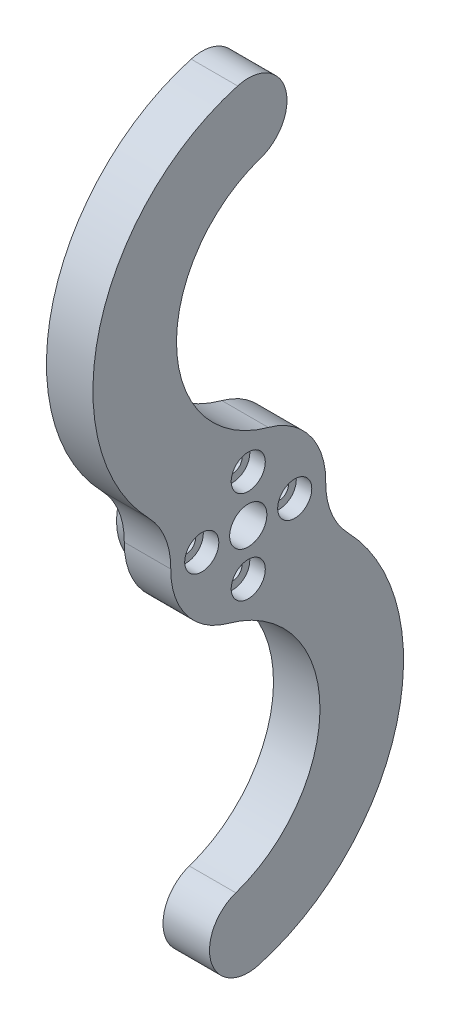
ISO-10303-21;
HEADER;
FILE_DESCRIPTION(('STEP AP214'),'2;1');
FILE_NAME('part.step','',(''),(''),'','','');
FILE_SCHEMA(('AUTOMOTIVE_DESIGN { 1 0 10303 214 1 1 1 1 }'));
ENDSEC;
DATA;
#1=APPLICATION_CONTEXT('core data for automotive mechanical design processes');
#2=APPLICATION_PROTOCOL_DEFINITION('international standard','automotive_design',2000,#1);
#3=PRODUCT_CONTEXT('',#1,'mechanical');
#4=PRODUCT('Part','Part','',(#3));
#5=PRODUCT_RELATED_PRODUCT_CATEGORY('part','',(#4));
#6=PRODUCT_DEFINITION_FORMATION('','',#4);
#7=PRODUCT_DEFINITION_CONTEXT('part definition',#1,'design');
#8=PRODUCT_DEFINITION('design','',#6,#7);
#9=PRODUCT_DEFINITION_SHAPE('','',#8);
#10=(LENGTH_UNIT() NAMED_UNIT(*) SI_UNIT(.MILLI.,.METRE.));
#11=(NAMED_UNIT(*) PLANE_ANGLE_UNIT() SI_UNIT($,.RADIAN.));
#12=(NAMED_UNIT(*) SI_UNIT($,.STERADIAN.) SOLID_ANGLE_UNIT());
#13=UNCERTAINTY_MEASURE_WITH_UNIT(LENGTH_MEASURE(1.E-05),#10,'distance_accuracy_value','');
#14=(GEOMETRIC_REPRESENTATION_CONTEXT(3) GLOBAL_UNCERTAINTY_ASSIGNED_CONTEXT((#13)) GLOBAL_UNIT_ASSIGNED_CONTEXT((#10,
#11,#12)) REPRESENTATION_CONTEXT('',''));
#15=CARTESIAN_POINT('',(0.,0.,0.));
#16=DIRECTION('',(0.,0.,1.));
#17=DIRECTION('',(1.,0.,0.));
#18=AXIS2_PLACEMENT_3D('',#15,#16,#17);
#19=CARTESIAN_POINT('',(0.,-12.5555555555556,3.37016686402291));
#20=DIRECTION('',(1.,0.,0.));
#21=DIRECTION('',(0.,0.,-1.));
#22=AXIS2_PLACEMENT_3D('',#19,#20,#21);
#23=PLANE('',#22);
#24=CARTESIAN_POINT('',(0.,-25.1111111111111,6.74033372804582));
#25=DIRECTION('',(-1.,0.,0.));
#26=DIRECTION('',(0.,0.,-1.));
#27=AXIS2_PLACEMENT_3D('',#24,#25,#26);
#28=CIRCLE('',#27,16.);
#29=CARTESIAN_POINT('',(0.,-9.65811965811966,2.5924360492484));
#30=VERTEX_POINT('',#29);
#31=CARTESIAN_POINT('',(0.,-40.2645502645503,1.60484136382043));
#32=VERTEX_POINT('',#31);
#33=EDGE_CURVE('E141',#30,#32,#28,.T.);
#34=ORIENTED_EDGE('',*,*,#33,.F.);
#35=CARTESIAN_POINT('',(0.,0.,0.));
#36=DIRECTION('',(1.,0.,0.));
#37=DIRECTION('',(0.,0.,-1.));
#38=AXIS2_PLACEMENT_3D('',#35,#36,#37);
#39=CIRCLE('',#38,10.);
#40=CARTESIAN_POINT('',(0.,0.123180910510112,9.99924129438259));
#41=VERTEX_POINT('',#40);
#42=EDGE_CURVE('E137',#41,#30,#39,.T.);
#43=ORIENTED_EDGE('',*,*,#42,.F.);
#44=CARTESIAN_POINT('',(0.,0.246361821020225,19.9984825887652));
#45=DIRECTION('',(1.,0.,0.));
#46=DIRECTION('',(0.,0.,-1.));
#47=AXIS2_PLACEMENT_3D('',#44,#45,#46);
#48=CIRCLE('',#47,10.);
#49=CARTESIAN_POINT('',(0.,7.20017566674365,12.8120736803447));
#50=VERTEX_POINT('',#49);
#51=EDGE_CURVE('E46',#41,#50,#48,.T.);
#52=ORIENTED_EDGE('',*,*,#51,.T.);
#53=CARTESIAN_POINT('',(0.,25.0789757885209,-5.66474656787445));
#54=DIRECTION('',(1.,0.,0.));
#55=DIRECTION('',(0.,0.,-1.));
#56=AXIS2_PLACEMENT_3D('',#53,#54,#55);
#57=CIRCLE('',#56,25.7107833462823);
#58=CARTESIAN_POINT('',(0.,49.8093362473069,1.3675824814506));
#59=VERTEX_POINT('',#58);
#60=EDGE_CURVE('E195',#59,#50,#57,.T.);
#61=ORIENTED_EDGE('',*,*,#60,.F.);
#62=CARTESIAN_POINT('',(0.,45.,-1.10295661595465E-06));
#63=DIRECTION('',(1.,0.,0.));
#64=DIRECTION('',(0.,0.,-1.));
#65=AXIS2_PLACEMENT_3D('',#62,#63,#64);
#66=CIRCLE('',#65,5.);
#67=CARTESIAN_POINT('',(0.,40.2645502252154,-1.60484235071048));
#68=VERTEX_POINT('',#67);
#69=EDGE_CURVE('E193',#68,#59,#66,.T.);
#70=ORIENTED_EDGE('',*,*,#69,.F.);
#71=CARTESIAN_POINT('',(0.,25.1111109459045,-6.74033434352284));
#72=DIRECTION('',(-1.,0.,0.));
#73=DIRECTION('',(0.,0.,-1.));
#74=AXIS2_PLACEMENT_3D('',#71,#72,#73);
#75=CIRCLE('',#74,16.);
#76=CARTESIAN_POINT('',(0.,9.65811959457867,-2.59243628597033));
#77=VERTEX_POINT('',#76);
#78=EDGE_CURVE('E187',#77,#68,#75,.T.);
#79=ORIENTED_EDGE('',*,*,#78,.F.);
#80=CARTESIAN_POINT('',(0.,0.,0.));
#81=DIRECTION('',(1.,0.,0.));
#82=DIRECTION('',(0.,0.,-1.));
#83=AXIS2_PLACEMENT_3D('',#80,#81,#82);
#84=CIRCLE('',#83,10.);
#85=CARTESIAN_POINT('',(0.,-0.123180665427243,-9.99924129740177));
#86=VERTEX_POINT('',#85);
#87=EDGE_CURVE('E182',#86,#77,#84,.T.);
#88=ORIENTED_EDGE('',*,*,#87,.F.);
#89=CARTESIAN_POINT('',(0.,-0.246361330854486,-19.9984825948035));
#90=DIRECTION('',(1.,0.,0.));
#91=DIRECTION('',(0.,0.,-1.));
#92=AXIS2_PLACEMENT_3D('',#89,#90,#91);
#93=CIRCLE('',#92,10.);
#94=CARTESIAN_POINT('',(0.,-7.20017535271785,-12.8120738568221));
#95=VERTEX_POINT('',#94);
#96=EDGE_CURVE('E159',#86,#95,#93,.T.);
#97=ORIENTED_EDGE('',*,*,#96,.T.);
#98=CARTESIAN_POINT('',(0.,-25.0789759273647,5.66474595318508));
#99=DIRECTION('',(1.,0.,0.));
#100=DIRECTION('',(0.,0.,-1.));
#101=AXIS2_PLACEMENT_3D('',#98,#99,#100);
#102=CIRCLE('',#101,25.7107833462823);
#103=CARTESIAN_POINT('',(0.,-49.8093362137872,-1.36758370228472));
#104=VERTEX_POINT('',#103);
#105=EDGE_CURVE('E180',#104,#95,#102,.T.);
#106=ORIENTED_EDGE('',*,*,#105,.F.);
#107=CARTESIAN_POINT('',(0.,-45.,0.));
#108=DIRECTION('',(1.,0.,0.));
#109=DIRECTION('',(0.,0.,-1.));
#110=AXIS2_PLACEMENT_3D('',#107,#108,#109);
#111=CIRCLE('',#110,5.);
#112=EDGE_CURVE('E185',#32,#104,#111,.T.);
#113=ORIENTED_EDGE('',*,*,#112,.F.);
#114=EDGE_LOOP('',(#34,#43,#52,#61,#70,#79,#88,#97,#106,#113));
#115=FACE_BOUND('',#114,.T.);
#116=CARTESIAN_POINT('',(0.,0.,0.));
#117=DIRECTION('',(1.,0.,0.));
#118=DIRECTION('',(0.,0.,-1.));
#119=AXIS2_PLACEMENT_3D('',#116,#117,#118);
#120=CIRCLE('',#119,8.);
#121=CARTESIAN_POINT('',(0.,0.,-8.));
#122=VERTEX_POINT('',#121);
#123=EDGE_CURVE('E142',#122,#122,#120,.F.);
#124=ORIENTED_EDGE('',*,*,#123,.F.);
#125=EDGE_LOOP('',(#124));
#126=FACE_BOUND('',#125,.T.);
#127=ADVANCED_FACE('F38',(#115,#126),#23,.F.);
#128=CARTESIAN_POINT('',(6.,-12.5555555555556,3.37016686402291));
#129=DIRECTION('',(1.,0.,0.));
#130=DIRECTION('',(0.,0.,-1.));
#131=AXIS2_PLACEMENT_3D('',#128,#129,#130);
#132=PLANE('',#131);
#133=CARTESIAN_POINT('',(6.,-6.,0.));
#134=DIRECTION('',(1.,0.,0.));
#135=DIRECTION('',(0.,0.,-1.));
#136=AXIS2_PLACEMENT_3D('',#133,#134,#135);
#137=CIRCLE('',#136,2.2);
#138=CARTESIAN_POINT('',(6.,-6.,-2.2));
#139=VERTEX_POINT('',#138);
#140=EDGE_CURVE('E279',#139,#139,#137,.T.);
#141=ORIENTED_EDGE('',*,*,#140,.F.);
#142=EDGE_LOOP('',(#141));
#143=FACE_BOUND('',#142,.T.);
#144=CARTESIAN_POINT('',(6.,0.,6.));
#145=DIRECTION('',(1.,0.,0.));
#146=DIRECTION('',(0.,0.,-1.));
#147=AXIS2_PLACEMENT_3D('',#144,#145,#146);
#148=CIRCLE('',#147,2.2);
#149=CARTESIAN_POINT('',(6.,0.,3.8));
#150=VERTEX_POINT('',#149);
#151=EDGE_CURVE('E267',#150,#150,#148,.T.);
#152=ORIENTED_EDGE('',*,*,#151,.F.);
#153=EDGE_LOOP('',(#152));
#154=FACE_BOUND('',#153,.T.);
#155=CARTESIAN_POINT('',(6.,6.,0.));
#156=DIRECTION('',(1.,0.,0.));
#157=DIRECTION('',(0.,0.,-1.));
#158=AXIS2_PLACEMENT_3D('',#155,#156,#157);
#159=CIRCLE('',#158,2.2);
#160=CARTESIAN_POINT('',(6.,6.,-2.2));
#161=VERTEX_POINT('',#160);
#162=EDGE_CURVE('E255',#161,#161,#159,.T.);
#163=ORIENTED_EDGE('',*,*,#162,.F.);
#164=EDGE_LOOP('',(#163));
#165=FACE_BOUND('',#164,.T.);
#166=CARTESIAN_POINT('',(6.,0.,-6.));
#167=DIRECTION('',(1.,0.,0.));
#168=DIRECTION('',(0.,0.,-1.));
#169=AXIS2_PLACEMENT_3D('',#166,#167,#168);
#170=CIRCLE('',#169,2.2);
#171=CARTESIAN_POINT('',(6.,0.,-8.2));
#172=VERTEX_POINT('',#171);
#173=EDGE_CURVE('E243',#172,#172,#170,.T.);
#174=ORIENTED_EDGE('',*,*,#173,.F.);
#175=EDGE_LOOP('',(#174));
#176=FACE_BOUND('',#175,.T.);
#177=CARTESIAN_POINT('',(6.,-25.1111111111111,6.74033372804582));
#178=DIRECTION('',(-1.,0.,0.));
#179=DIRECTION('',(0.,0.,-1.));
#180=AXIS2_PLACEMENT_3D('',#177,#178,#179);
#181=CIRCLE('',#180,16.);
#182=CARTESIAN_POINT('',(6.,-9.65811965811966,2.5924360492484));
#183=VERTEX_POINT('',#182);
#184=CARTESIAN_POINT('',(6.,-40.2645502645503,1.60484136382043));
#185=VERTEX_POINT('',#184);
#186=EDGE_CURVE('E127',#183,#185,#181,.T.);
#187=ORIENTED_EDGE('',*,*,#186,.T.);
#188=CARTESIAN_POINT('',(6.,-45.,0.));
#189=DIRECTION('',(1.,0.,0.));
#190=DIRECTION('',(0.,0.,-1.));
#191=AXIS2_PLACEMENT_3D('',#188,#189,#190);
#192=CIRCLE('',#191,5.);
#193=CARTESIAN_POINT('',(6.,-49.8093362137872,-1.36758370228472));
#194=VERTEX_POINT('',#193);
#195=EDGE_CURVE('E115',#185,#194,#192,.T.);
#196=ORIENTED_EDGE('',*,*,#195,.T.);
#197=CARTESIAN_POINT('',(6.,-25.0789759273647,5.66474595318508));
#198=DIRECTION('',(1.,0.,0.));
#199=DIRECTION('',(0.,0.,-1.));
#200=AXIS2_PLACEMENT_3D('',#197,#198,#199);
#201=CIRCLE('',#200,25.7107833462823);
#202=CARTESIAN_POINT('',(6.,-7.20017535271785,-12.8120738568221));
#203=VERTEX_POINT('',#202);
#204=EDGE_CURVE('E126',#194,#203,#201,.T.);
#205=ORIENTED_EDGE('',*,*,#204,.T.);
#206=CARTESIAN_POINT('',(6.,-0.246361330854486,-19.9984825948035));
#207=DIRECTION('',(1.,0.,0.));
#208=DIRECTION('',(0.,0.,-1.));
#209=AXIS2_PLACEMENT_3D('',#206,#207,#208);
#210=CIRCLE('',#209,10.);
#211=CARTESIAN_POINT('',(6.,-0.123180665427243,-9.99924129740177));
#212=VERTEX_POINT('',#211);
#213=EDGE_CURVE('E161',#203,#212,#210,.F.);
#214=ORIENTED_EDGE('',*,*,#213,.T.);
#215=CARTESIAN_POINT('',(6.,0.,0.));
#216=DIRECTION('',(1.,0.,0.));
#217=DIRECTION('',(0.,0.,-1.));
#218=AXIS2_PLACEMENT_3D('',#215,#216,#217);
#219=CIRCLE('',#218,10.);
#220=CARTESIAN_POINT('',(6.,9.65811959457867,-2.59243628597033));
#221=VERTEX_POINT('',#220);
#222=EDGE_CURVE('E164',#212,#221,#219,.T.);
#223=ORIENTED_EDGE('',*,*,#222,.T.);
#224=CARTESIAN_POINT('',(6.,25.1111109459045,-6.74033434352284));
#225=DIRECTION('',(-1.,0.,0.));
#226=DIRECTION('',(0.,0.,-1.));
#227=AXIS2_PLACEMENT_3D('',#224,#225,#226);
#228=CIRCLE('',#227,16.);
#229=CARTESIAN_POINT('',(6.,40.2645502252154,-1.60484235071048));
#230=VERTEX_POINT('',#229);
#231=EDGE_CURVE('E174',#221,#230,#228,.T.);
#232=ORIENTED_EDGE('',*,*,#231,.T.);
#233=CARTESIAN_POINT('',(6.,45.,-1.10295661595465E-06));
#234=DIRECTION('',(1.,0.,0.));
#235=DIRECTION('',(0.,0.,-1.));
#236=AXIS2_PLACEMENT_3D('',#233,#234,#235);
#237=CIRCLE('',#236,5.);
#238=CARTESIAN_POINT('',(6.,49.8093362473069,1.3675824814506));
#239=VERTEX_POINT('',#238);
#240=EDGE_CURVE('E216',#230,#239,#237,.T.);
#241=ORIENTED_EDGE('',*,*,#240,.T.);
#242=CARTESIAN_POINT('',(6.,25.0789757885209,-5.66474656787445));
#243=DIRECTION('',(1.,0.,0.));
#244=DIRECTION('',(0.,0.,-1.));
#245=AXIS2_PLACEMENT_3D('',#242,#243,#244);
#246=CIRCLE('',#245,25.7107833462823);
#247=CARTESIAN_POINT('',(6.,7.20017566674365,12.8120736803447));
#248=VERTEX_POINT('',#247);
#249=EDGE_CURVE('E214',#239,#248,#246,.T.);
#250=ORIENTED_EDGE('',*,*,#249,.T.);
#251=CARTESIAN_POINT('',(6.,0.246361821020225,19.9984825887652));
#252=DIRECTION('',(1.,0.,0.));
#253=DIRECTION('',(0.,0.,-1.));
#254=AXIS2_PLACEMENT_3D('',#251,#252,#253);
#255=CIRCLE('',#254,10.);
#256=CARTESIAN_POINT('',(6.,0.123180910510112,9.99924129438259));
#257=VERTEX_POINT('',#256);
#258=EDGE_CURVE('E11',#248,#257,#255,.F.);
#259=ORIENTED_EDGE('',*,*,#258,.T.);
#260=CARTESIAN_POINT('',(6.,0.,0.));
#261=DIRECTION('',(1.,0.,0.));
#262=DIRECTION('',(0.,0.,-1.));
#263=AXIS2_PLACEMENT_3D('',#260,#261,#262);
#264=CIRCLE('',#263,10.);
#265=EDGE_CURVE('E133',#257,#183,#264,.T.);
#266=ORIENTED_EDGE('',*,*,#265,.T.);
#267=EDGE_LOOP('',(#187,#196,#205,#214,#223,#232,#241,#250,#259,#266));
#268=FACE_BOUND('',#267,.T.);
#269=CARTESIAN_POINT('',(6.,0.,0.));
#270=DIRECTION('',(1.,0.,0.));
#271=DIRECTION('',(0.,0.,-1.));
#272=AXIS2_PLACEMENT_3D('',#269,#270,#271);
#273=CIRCLE('',#272,2.4);
#274=CARTESIAN_POINT('',(6.,0.,-2.4));
#275=VERTEX_POINT('',#274);
#276=EDGE_CURVE('E221',#275,#275,#273,.T.);
#277=ORIENTED_EDGE('',*,*,#276,.F.);
#278=EDGE_LOOP('',(#277));
#279=FACE_BOUND('',#278,.T.);
#280=ADVANCED_FACE('F130',(#143,#154,#165,#176,#268,#279),#132,.T.);
#281=CARTESIAN_POINT('',(6.,-25.1111111111111,6.74033372804582));
#282=DIRECTION('',(-1.,0.,0.));
#283=DIRECTION('',(0.,0.,1.));
#284=AXIS2_PLACEMENT_3D('',#281,#282,#283);
#285=CYLINDRICAL_SURFACE('',#284,16.);
#286=ORIENTED_EDGE('',*,*,#33,.T.);
#287=DIRECTION('',(-1.,0.,0.));
#288=VECTOR('',#287,1.);
#289=CARTESIAN_POINT('',(6.,-40.2645502645503,1.60484136382043));
#290=LINE('',#289,#288);
#291=EDGE_CURVE('E119',#185,#32,#290,.T.);
#292=ORIENTED_EDGE('',*,*,#291,.F.);
#293=ORIENTED_EDGE('',*,*,#186,.F.);
#294=DIRECTION('',(-1.,0.,0.));
#295=VECTOR('',#294,1.);
#296=CARTESIAN_POINT('',(6.,-9.65811965811966,2.5924360492484));
#297=LINE('',#296,#295);
#298=EDGE_CURVE('E198',#183,#30,#297,.T.);
#299=ORIENTED_EDGE('',*,*,#298,.T.);
#300=EDGE_LOOP('',(#286,#292,#293,#299));
#301=FACE_BOUND('',#300,.T.);
#302=ADVANCED_FACE('F139',(#301),#285,.F.);
#303=CARTESIAN_POINT('',(6.,-45.,0.));
#304=DIRECTION('',(-1.,0.,0.));
#305=DIRECTION('',(0.,0.,1.));
#306=AXIS2_PLACEMENT_3D('',#303,#304,#305);
#307=CYLINDRICAL_SURFACE('',#306,5.);
#308=ORIENTED_EDGE('',*,*,#112,.T.);
#309=DIRECTION('',(-1.,0.,0.));
#310=VECTOR('',#309,1.);
#311=CARTESIAN_POINT('',(6.,-49.8093362137872,-1.36758370228472));
#312=LINE('',#311,#310);
#313=EDGE_CURVE('E122',#194,#104,#312,.T.);
#314=ORIENTED_EDGE('',*,*,#313,.F.);
#315=ORIENTED_EDGE('',*,*,#195,.F.);
#316=ORIENTED_EDGE('',*,*,#291,.T.);
#317=EDGE_LOOP('',(#308,#314,#315,#316));
#318=FACE_BOUND('',#317,.T.);
#319=ADVANCED_FACE('F117',(#318),#307,.T.);
#320=CARTESIAN_POINT('',(6.,-25.0789759273647,5.66474595318508));
#321=DIRECTION('',(-1.,0.,0.));
#322=DIRECTION('',(0.,0.,1.));
#323=AXIS2_PLACEMENT_3D('',#320,#321,#322);
#324=CYLINDRICAL_SURFACE('',#323,25.7107833462823);
#325=ORIENTED_EDGE('',*,*,#105,.T.);
#326=DIRECTION('',(-1.,0.,0.));
#327=VECTOR('',#326,1.);
#328=CARTESIAN_POINT('',(6.,-7.20017535271784,-12.8120738568221));
#329=LINE('',#328,#327);
#330=EDGE_CURVE('E153',#95,#203,#329,.F.);
#331=ORIENTED_EDGE('',*,*,#330,.T.);
#332=ORIENTED_EDGE('',*,*,#204,.F.);
#333=ORIENTED_EDGE('',*,*,#313,.T.);
#334=EDGE_LOOP('',(#325,#331,#332,#333));
#335=FACE_BOUND('',#334,.T.);
#336=ADVANCED_FACE('F184',(#335),#324,.T.);
#337=CARTESIAN_POINT('',(6.,0.,0.));
#338=DIRECTION('',(-1.,0.,0.));
#339=DIRECTION('',(0.,0.,1.));
#340=AXIS2_PLACEMENT_3D('',#337,#338,#339);
#341=CYLINDRICAL_SURFACE('',#340,10.);
#342=ORIENTED_EDGE('',*,*,#222,.F.);
#343=DIRECTION('',(-1.,0.,0.));
#344=VECTOR('',#343,1.);
#345=CARTESIAN_POINT('',(6.,-0.123180665427243,-9.99924129740177));
#346=LINE('',#345,#344);
#347=EDGE_CURVE('E145',#212,#86,#346,.T.);
#348=ORIENTED_EDGE('',*,*,#347,.T.);
#349=ORIENTED_EDGE('',*,*,#87,.T.);
#350=DIRECTION('',(-1.,0.,0.));
#351=VECTOR('',#350,1.);
#352=CARTESIAN_POINT('',(6.,9.65811959457867,-2.59243628597033));
#353=LINE('',#352,#351);
#354=EDGE_CURVE('E147',#221,#77,#353,.T.);
#355=ORIENTED_EDGE('',*,*,#354,.F.);
#356=EDGE_LOOP('',(#342,#348,#349,#355));
#357=FACE_BOUND('',#356,.T.);
#358=ADVANCED_FACE('F170',(#357),#341,.T.);
#359=CARTESIAN_POINT('',(6.,25.1111109459045,-6.74033434352284));
#360=DIRECTION('',(-1.,0.,0.));
#361=DIRECTION('',(0.,0.,1.));
#362=AXIS2_PLACEMENT_3D('',#359,#360,#361);
#363=CYLINDRICAL_SURFACE('',#362,16.);
#364=ORIENTED_EDGE('',*,*,#78,.T.);
#365=DIRECTION('',(-1.,0.,0.));
#366=VECTOR('',#365,1.);
#367=CARTESIAN_POINT('',(6.,40.2645502252154,-1.60484235071048));
#368=LINE('',#367,#366);
#369=EDGE_CURVE('E203',#230,#68,#368,.T.);
#370=ORIENTED_EDGE('',*,*,#369,.F.);
#371=ORIENTED_EDGE('',*,*,#231,.F.);
#372=ORIENTED_EDGE('',*,*,#354,.T.);
#373=EDGE_LOOP('',(#364,#370,#371,#372));
#374=FACE_BOUND('',#373,.T.);
#375=ADVANCED_FACE('F206',(#374),#363,.F.);
#376=CARTESIAN_POINT('',(6.,45.,-1.10295661595465E-06));
#377=DIRECTION('',(-1.,0.,0.));
#378=DIRECTION('',(0.,0.,1.));
#379=AXIS2_PLACEMENT_3D('',#376,#377,#378);
#380=CYLINDRICAL_SURFACE('',#379,5.);
#381=ORIENTED_EDGE('',*,*,#69,.T.);
#382=DIRECTION('',(-1.,0.,0.));
#383=VECTOR('',#382,1.);
#384=CARTESIAN_POINT('',(6.,49.8093362473069,1.3675824814506));
#385=LINE('',#384,#383);
#386=EDGE_CURVE('E200',#239,#59,#385,.T.);
#387=ORIENTED_EDGE('',*,*,#386,.F.);
#388=ORIENTED_EDGE('',*,*,#240,.F.);
#389=ORIENTED_EDGE('',*,*,#369,.T.);
#390=EDGE_LOOP('',(#381,#387,#388,#389));
#391=FACE_BOUND('',#390,.T.);
#392=ADVANCED_FACE('F211',(#391),#380,.T.);
#393=CARTESIAN_POINT('',(6.,25.0789757885209,-5.66474656787445));
#394=DIRECTION('',(-1.,0.,0.));
#395=DIRECTION('',(0.,0.,1.));
#396=AXIS2_PLACEMENT_3D('',#393,#394,#395);
#397=CYLINDRICAL_SURFACE('',#396,25.7107833462823);
#398=ORIENTED_EDGE('',*,*,#60,.T.);
#399=DIRECTION('',(-1.,0.,0.));
#400=VECTOR('',#399,1.);
#401=CARTESIAN_POINT('',(6.,7.20017566674365,12.8120736803447));
#402=LINE('',#401,#400);
#403=EDGE_CURVE('E53',#50,#248,#402,.F.);
#404=ORIENTED_EDGE('',*,*,#403,.T.);
#405=ORIENTED_EDGE('',*,*,#249,.F.);
#406=ORIENTED_EDGE('',*,*,#386,.T.);
#407=EDGE_LOOP('',(#398,#404,#405,#406));
#408=FACE_BOUND('',#407,.T.);
#409=ADVANCED_FACE('F213',(#408),#397,.T.);
#410=CARTESIAN_POINT('',(6.,0.,0.));
#411=DIRECTION('',(-1.,0.,0.));
#412=DIRECTION('',(0.,0.,1.));
#413=AXIS2_PLACEMENT_3D('',#410,#411,#412);
#414=CYLINDRICAL_SURFACE('',#413,10.);
#415=ORIENTED_EDGE('',*,*,#265,.F.);
#416=DIRECTION('',(-1.,0.,0.));
#417=VECTOR('',#416,1.);
#418=CARTESIAN_POINT('',(6.,0.123180910510112,9.99924129438259));
#419=LINE('',#418,#417);
#420=EDGE_CURVE('E155',#257,#41,#419,.T.);
#421=ORIENTED_EDGE('',*,*,#420,.T.);
#422=ORIENTED_EDGE('',*,*,#42,.T.);
#423=ORIENTED_EDGE('',*,*,#298,.F.);
#424=EDGE_LOOP('',(#415,#421,#422,#423));
#425=FACE_BOUND('',#424,.T.);
#426=ADVANCED_FACE('F317',(#425),#414,.T.);
#427=CARTESIAN_POINT('',(6.,0.,0.));
#428=DIRECTION('',(-1.,0.,0.));
#429=DIRECTION('',(0.,0.,1.));
#430=AXIS2_PLACEMENT_3D('',#427,#428,#429);
#431=CYLINDRICAL_SURFACE('',#430,2.4);
#432=ORIENTED_EDGE('',*,*,#276,.T.);
#433=EDGE_LOOP('',(#432));
#434=FACE_BOUND('',#433,.T.);
#435=CARTESIAN_POINT('',(-3.,0.,0.));
#436=DIRECTION('',(-1.,0.,0.));
#437=DIRECTION('',(0.,0.,1.));
#438=AXIS2_PLACEMENT_3D('',#435,#436,#437);
#439=CIRCLE('',#438,2.4);
#440=CARTESIAN_POINT('',(-3.,0.,2.4));
#441=VERTEX_POINT('',#440);
#442=EDGE_CURVE('E228',#441,#441,#439,.T.);
#443=ORIENTED_EDGE('',*,*,#442,.T.);
#444=EDGE_LOOP('',(#443));
#445=FACE_BOUND('',#444,.T.);
#446=ADVANCED_FACE('F320',(#434,#445),#431,.F.);
#447=CARTESIAN_POINT('',(-3.,0.,0.));
#448=DIRECTION('',(-1.,0.,0.));
#449=DIRECTION('',(0.,0.,1.));
#450=AXIS2_PLACEMENT_3D('',#447,#448,#449);
#451=PLANE('',#450);
#452=CARTESIAN_POINT('',(-3.,-6.,0.));
#453=DIRECTION('',(1.,0.,0.));
#454=DIRECTION('',(0.,0.,-1.));
#455=AXIS2_PLACEMENT_3D('',#452,#453,#454);
#456=CIRCLE('',#455,1.2);
#457=CARTESIAN_POINT('',(-3.,-6.,-1.2));
#458=VERTEX_POINT('',#457);
#459=EDGE_CURVE('E270',#458,#458,#456,.T.);
#460=ORIENTED_EDGE('',*,*,#459,.T.);
#461=EDGE_LOOP('',(#460));
#462=FACE_BOUND('',#461,.T.);
#463=CARTESIAN_POINT('',(-3.,0.,6.));
#464=DIRECTION('',(1.,0.,0.));
#465=DIRECTION('',(0.,0.,-1.));
#466=AXIS2_PLACEMENT_3D('',#463,#464,#465);
#467=CIRCLE('',#466,1.2);
#468=CARTESIAN_POINT('',(-3.,0.,4.8));
#469=VERTEX_POINT('',#468);
#470=EDGE_CURVE('E258',#469,#469,#467,.T.);
#471=ORIENTED_EDGE('',*,*,#470,.T.);
#472=EDGE_LOOP('',(#471));
#473=FACE_BOUND('',#472,.T.);
#474=CARTESIAN_POINT('',(-3.,6.,0.));
#475=DIRECTION('',(1.,0.,0.));
#476=DIRECTION('',(0.,0.,-1.));
#477=AXIS2_PLACEMENT_3D('',#474,#475,#476);
#478=CIRCLE('',#477,1.2);
#479=CARTESIAN_POINT('',(-3.,6.,-1.2));
#480=VERTEX_POINT('',#479);
#481=EDGE_CURVE('E246',#480,#480,#478,.T.);
#482=ORIENTED_EDGE('',*,*,#481,.T.);
#483=EDGE_LOOP('',(#482));
#484=FACE_BOUND('',#483,.T.);
#485=CARTESIAN_POINT('',(-3.,0.,-6.));
#486=DIRECTION('',(1.,0.,0.));
#487=DIRECTION('',(0.,0.,-1.));
#488=AXIS2_PLACEMENT_3D('',#485,#486,#487);
#489=CIRCLE('',#488,1.2);
#490=CARTESIAN_POINT('',(-3.,0.,-7.2));
#491=VERTEX_POINT('',#490);
#492=EDGE_CURVE('E234',#491,#491,#489,.T.);
#493=ORIENTED_EDGE('',*,*,#492,.T.);
#494=EDGE_LOOP('',(#493));
#495=FACE_BOUND('',#494,.T.);
#496=CARTESIAN_POINT('',(-3.,0.,0.));
#497=DIRECTION('',(-1.,0.,0.));
#498=DIRECTION('',(0.,0.,1.));
#499=AXIS2_PLACEMENT_3D('',#496,#497,#498);
#500=CIRCLE('',#499,8.);
#501=CARTESIAN_POINT('',(-3.,0.,8.));
#502=VERTEX_POINT('',#501);
#503=EDGE_CURVE('E223',#502,#502,#500,.T.);
#504=ORIENTED_EDGE('',*,*,#503,.T.);
#505=EDGE_LOOP('',(#504));
#506=FACE_BOUND('',#505,.T.);
#507=ORIENTED_EDGE('',*,*,#442,.F.);
#508=EDGE_LOOP('',(#507));
#509=FACE_BOUND('',#508,.T.);
#510=ADVANCED_FACE('F473',(#462,#473,#484,#495,#506,#509),#451,.T.);
#511=CARTESIAN_POINT('',(-3.,0.,0.));
#512=DIRECTION('',(1.,0.,0.));
#513=DIRECTION('',(0.,0.,-1.));
#514=AXIS2_PLACEMENT_3D('',#511,#512,#513);
#515=CYLINDRICAL_SURFACE('',#514,8.);
#516=ORIENTED_EDGE('',*,*,#503,.F.);
#517=EDGE_LOOP('',(#516));
#518=FACE_BOUND('',#517,.T.);
#519=ORIENTED_EDGE('',*,*,#123,.T.);
#520=EDGE_LOOP('',(#519));
#521=FACE_BOUND('',#520,.T.);
#522=ADVANCED_FACE('F480',(#518,#521),#515,.T.);
#523=CARTESIAN_POINT('',(6.,0.,-6.));
#524=DIRECTION('',(1.,0.,0.));
#525=DIRECTION('',(0.,0.,-1.));
#526=AXIS2_PLACEMENT_3D('',#523,#524,#525);
#527=CYLINDRICAL_SURFACE('',#526,1.2);
#528=ORIENTED_EDGE('',*,*,#492,.F.);
#529=EDGE_LOOP('',(#528));
#530=FACE_BOUND('',#529,.T.);
#531=CARTESIAN_POINT('',(4.,0.,-6.));
#532=DIRECTION('',(1.,0.,0.));
#533=DIRECTION('',(0.,0.,-1.));
#534=AXIS2_PLACEMENT_3D('',#531,#532,#533);
#535=CIRCLE('',#534,1.2);
#536=CARTESIAN_POINT('',(4.,0.,-7.2));
#537=VERTEX_POINT('',#536);
#538=EDGE_CURVE('E237',#537,#537,#535,.T.);
#539=ORIENTED_EDGE('',*,*,#538,.T.);
#540=EDGE_LOOP('',(#539));
#541=FACE_BOUND('',#540,.T.);
#542=ADVANCED_FACE('F307',(#530,#541),#527,.F.);
#543=CARTESIAN_POINT('',(4.,1.2,-6.));
#544=DIRECTION('',(-1.,0.,0.));
#545=DIRECTION('',(0.,0.,1.));
#546=AXIS2_PLACEMENT_3D('',#543,#544,#545);
#547=PLANE('',#546);
#548=ORIENTED_EDGE('',*,*,#538,.F.);
#549=EDGE_LOOP('',(#548));
#550=FACE_BOUND('',#549,.T.);
#551=CARTESIAN_POINT('',(4.,0.,-6.));
#552=DIRECTION('',(1.,0.,0.));
#553=DIRECTION('',(0.,0.,-1.));
#554=AXIS2_PLACEMENT_3D('',#551,#552,#553);
#555=CIRCLE('',#554,2.2);
#556=CARTESIAN_POINT('',(4.,0.,-8.2));
#557=VERTEX_POINT('',#556);
#558=EDGE_CURVE('E240',#557,#557,#555,.T.);
#559=ORIENTED_EDGE('',*,*,#558,.T.);
#560=EDGE_LOOP('',(#559));
#561=FACE_BOUND('',#560,.T.);
#562=ADVANCED_FACE('F297',(#550,#561),#547,.F.);
#563=CARTESIAN_POINT('',(6.,0.,-6.));
#564=DIRECTION('',(1.,0.,0.));
#565=DIRECTION('',(0.,0.,-1.));
#566=AXIS2_PLACEMENT_3D('',#563,#564,#565);
#567=CYLINDRICAL_SURFACE('',#566,2.2);
#568=ORIENTED_EDGE('',*,*,#558,.F.);
#569=EDGE_LOOP('',(#568));
#570=FACE_BOUND('',#569,.T.);
#571=ORIENTED_EDGE('',*,*,#173,.T.);
#572=EDGE_LOOP('',(#571));
#573=FACE_BOUND('',#572,.T.);
#574=ADVANCED_FACE('F294',(#570,#573),#567,.F.);
#575=CARTESIAN_POINT('',(6.,6.,0.));
#576=DIRECTION('',(1.,0.,0.));
#577=DIRECTION('',(0.,0.,-1.));
#578=AXIS2_PLACEMENT_3D('',#575,#576,#577);
#579=CYLINDRICAL_SURFACE('',#578,1.2);
#580=ORIENTED_EDGE('',*,*,#481,.F.);
#581=EDGE_LOOP('',(#580));
#582=FACE_BOUND('',#581,.T.);
#583=CARTESIAN_POINT('',(4.,6.,0.));
#584=DIRECTION('',(1.,0.,0.));
#585=DIRECTION('',(0.,0.,-1.));
#586=AXIS2_PLACEMENT_3D('',#583,#584,#585);
#587=CIRCLE('',#586,1.2);
#588=CARTESIAN_POINT('',(4.,6.,-1.2));
#589=VERTEX_POINT('',#588);
#590=EDGE_CURVE('E249',#589,#589,#587,.T.);
#591=ORIENTED_EDGE('',*,*,#590,.T.);
#592=EDGE_LOOP('',(#591));
#593=FACE_BOUND('',#592,.T.);
#594=ADVANCED_FACE('F296',(#582,#593),#579,.F.);
#595=CARTESIAN_POINT('',(4.,7.2,0.));
#596=DIRECTION('',(-1.,0.,0.));
#597=DIRECTION('',(0.,0.,1.));
#598=AXIS2_PLACEMENT_3D('',#595,#596,#597);
#599=PLANE('',#598);
#600=ORIENTED_EDGE('',*,*,#590,.F.);
#601=EDGE_LOOP('',(#600));
#602=FACE_BOUND('',#601,.T.);
#603=CARTESIAN_POINT('',(4.,6.,0.));
#604=DIRECTION('',(1.,0.,0.));
#605=DIRECTION('',(0.,0.,-1.));
#606=AXIS2_PLACEMENT_3D('',#603,#604,#605);
#607=CIRCLE('',#606,2.2);
#608=CARTESIAN_POINT('',(4.,6.,-2.2));
#609=VERTEX_POINT('',#608);
#610=EDGE_CURVE('E252',#609,#609,#607,.T.);
#611=ORIENTED_EDGE('',*,*,#610,.T.);
#612=EDGE_LOOP('',(#611));
#613=FACE_BOUND('',#612,.T.);
#614=ADVANCED_FACE('F304',(#602,#613),#599,.F.);
#615=CARTESIAN_POINT('',(6.,6.,0.));
#616=DIRECTION('',(1.,0.,0.));
#617=DIRECTION('',(0.,0.,-1.));
#618=AXIS2_PLACEMENT_3D('',#615,#616,#617);
#619=CYLINDRICAL_SURFACE('',#618,2.2);
#620=ORIENTED_EDGE('',*,*,#610,.F.);
#621=EDGE_LOOP('',(#620));
#622=FACE_BOUND('',#621,.T.);
#623=ORIENTED_EDGE('',*,*,#162,.T.);
#624=EDGE_LOOP('',(#623));
#625=FACE_BOUND('',#624,.T.);
#626=ADVANCED_FACE('F366',(#622,#625),#619,.F.);
#627=CARTESIAN_POINT('',(6.,0.,6.));
#628=DIRECTION('',(1.,0.,0.));
#629=DIRECTION('',(0.,0.,-1.));
#630=AXIS2_PLACEMENT_3D('',#627,#628,#629);
#631=CYLINDRICAL_SURFACE('',#630,1.2);
#632=ORIENTED_EDGE('',*,*,#470,.F.);
#633=EDGE_LOOP('',(#632));
#634=FACE_BOUND('',#633,.T.);
#635=CARTESIAN_POINT('',(4.,0.,6.));
#636=DIRECTION('',(1.,0.,0.));
#637=DIRECTION('',(0.,0.,-1.));
#638=AXIS2_PLACEMENT_3D('',#635,#636,#637);
#639=CIRCLE('',#638,1.2);
#640=CARTESIAN_POINT('',(4.,0.,4.8));
#641=VERTEX_POINT('',#640);
#642=EDGE_CURVE('E261',#641,#641,#639,.T.);
#643=ORIENTED_EDGE('',*,*,#642,.T.);
#644=EDGE_LOOP('',(#643));
#645=FACE_BOUND('',#644,.T.);
#646=ADVANCED_FACE('F362',(#634,#645),#631,.F.);
#647=CARTESIAN_POINT('',(4.,1.2,6.));
#648=DIRECTION('',(-1.,0.,0.));
#649=DIRECTION('',(0.,0.,1.));
#650=AXIS2_PLACEMENT_3D('',#647,#648,#649);
#651=PLANE('',#650);
#652=ORIENTED_EDGE('',*,*,#642,.F.);
#653=EDGE_LOOP('',(#652));
#654=FACE_BOUND('',#653,.T.);
#655=CARTESIAN_POINT('',(4.,0.,6.));
#656=DIRECTION('',(1.,0.,0.));
#657=DIRECTION('',(0.,0.,-1.));
#658=AXIS2_PLACEMENT_3D('',#655,#656,#657);
#659=CIRCLE('',#658,2.2);
#660=CARTESIAN_POINT('',(4.,0.,3.8));
#661=VERTEX_POINT('',#660);
#662=EDGE_CURVE('E264',#661,#661,#659,.T.);
#663=ORIENTED_EDGE('',*,*,#662,.T.);
#664=EDGE_LOOP('',(#663));
#665=FACE_BOUND('',#664,.T.);
#666=ADVANCED_FACE('F358',(#654,#665),#651,.F.);
#667=CARTESIAN_POINT('',(6.,0.,6.));
#668=DIRECTION('',(1.,0.,0.));
#669=DIRECTION('',(0.,0.,-1.));
#670=AXIS2_PLACEMENT_3D('',#667,#668,#669);
#671=CYLINDRICAL_SURFACE('',#670,2.2);
#672=ORIENTED_EDGE('',*,*,#662,.F.);
#673=EDGE_LOOP('',(#672));
#674=FACE_BOUND('',#673,.T.);
#675=ORIENTED_EDGE('',*,*,#151,.T.);
#676=EDGE_LOOP('',(#675));
#677=FACE_BOUND('',#676,.T.);
#678=ADVANCED_FACE('F354',(#674,#677),#671,.F.);
#679=CARTESIAN_POINT('',(6.,-6.,0.));
#680=DIRECTION('',(1.,0.,0.));
#681=DIRECTION('',(0.,0.,-1.));
#682=AXIS2_PLACEMENT_3D('',#679,#680,#681);
#683=CYLINDRICAL_SURFACE('',#682,1.2);
#684=ORIENTED_EDGE('',*,*,#459,.F.);
#685=EDGE_LOOP('',(#684));
#686=FACE_BOUND('',#685,.T.);
#687=CARTESIAN_POINT('',(4.,-6.,0.));
#688=DIRECTION('',(1.,0.,0.));
#689=DIRECTION('',(0.,0.,-1.));
#690=AXIS2_PLACEMENT_3D('',#687,#688,#689);
#691=CIRCLE('',#690,1.2);
#692=CARTESIAN_POINT('',(4.,-6.,-1.2));
#693=VERTEX_POINT('',#692);
#694=EDGE_CURVE('E273',#693,#693,#691,.T.);
#695=ORIENTED_EDGE('',*,*,#694,.T.);
#696=EDGE_LOOP('',(#695));
#697=FACE_BOUND('',#696,.T.);
#698=ADVANCED_FACE('F347',(#686,#697),#683,.F.);
#699=CARTESIAN_POINT('',(4.,-4.8,0.));
#700=DIRECTION('',(-1.,0.,0.));
#701=DIRECTION('',(0.,0.,1.));
#702=AXIS2_PLACEMENT_3D('',#699,#700,#701);
#703=PLANE('',#702);
#704=ORIENTED_EDGE('',*,*,#694,.F.);
#705=EDGE_LOOP('',(#704));
#706=FACE_BOUND('',#705,.T.);
#707=CARTESIAN_POINT('',(4.,-6.,0.));
#708=DIRECTION('',(1.,0.,0.));
#709=DIRECTION('',(0.,0.,-1.));
#710=AXIS2_PLACEMENT_3D('',#707,#708,#709);
#711=CIRCLE('',#710,2.2);
#712=CARTESIAN_POINT('',(4.,-6.,-2.2));
#713=VERTEX_POINT('',#712);
#714=EDGE_CURVE('E276',#713,#713,#711,.T.);
#715=ORIENTED_EDGE('',*,*,#714,.T.);
#716=EDGE_LOOP('',(#715));
#717=FACE_BOUND('',#716,.T.);
#718=ADVANCED_FACE('F341',(#706,#717),#703,.F.);
#719=CARTESIAN_POINT('',(6.,-6.,0.));
#720=DIRECTION('',(1.,0.,0.));
#721=DIRECTION('',(0.,0.,-1.));
#722=AXIS2_PLACEMENT_3D('',#719,#720,#721);
#723=CYLINDRICAL_SURFACE('',#722,2.2);
#724=ORIENTED_EDGE('',*,*,#714,.F.);
#725=EDGE_LOOP('',(#724));
#726=FACE_BOUND('',#725,.T.);
#727=ORIENTED_EDGE('',*,*,#140,.T.);
#728=EDGE_LOOP('',(#727));
#729=FACE_BOUND('',#728,.T.);
#730=ADVANCED_FACE('F283',(#726,#729),#723,.F.);
#731=CARTESIAN_POINT('',(6.,-0.246361330854486,-19.9984825948035));
#732=DIRECTION('',(1.,0.,0.));
#733=DIRECTION('',(0.,0.,-1.));
#734=AXIS2_PLACEMENT_3D('',#731,#732,#733);
#735=CYLINDRICAL_SURFACE('',#734,10.);
#736=ORIENTED_EDGE('',*,*,#213,.F.);
#737=ORIENTED_EDGE('',*,*,#330,.F.);
#738=ORIENTED_EDGE('',*,*,#96,.F.);
#739=ORIENTED_EDGE('',*,*,#347,.F.);
#740=EDGE_LOOP('',(#736,#737,#738,#739));
#741=FACE_BOUND('',#740,.T.);
#742=ADVANCED_FACE('F176',(#741),#735,.F.);
#743=CARTESIAN_POINT('',(6.,0.246361821020225,19.9984825887652));
#744=DIRECTION('',(1.,0.,0.));
#745=DIRECTION('',(0.,0.,-1.));
#746=AXIS2_PLACEMENT_3D('',#743,#744,#745);
#747=CYLINDRICAL_SURFACE('',#746,10.);
#748=ORIENTED_EDGE('',*,*,#258,.F.);
#749=ORIENTED_EDGE('',*,*,#403,.F.);
#750=ORIENTED_EDGE('',*,*,#51,.F.);
#751=ORIENTED_EDGE('',*,*,#420,.F.);
#752=EDGE_LOOP('',(#748,#749,#750,#751));
#753=FACE_BOUND('',#752,.T.);
#754=ADVANCED_FACE('F40',(#753),#747,.F.);
#755=CLOSED_SHELL('',(#127,#280,#302,#319,#336,#358,#375,#392,#409,#426,#446,#510,#522,#542,
#562,#574,#594,#614,#626,#646,#666,#678,#698,#718,#730,#742,#754));
#756=MANIFOLD_SOLID_BREP('B2',#755);
#757=ADVANCED_BREP_SHAPE_REPRESENTATION('',(#18,#756),#14);
#758=SHAPE_DEFINITION_REPRESENTATION(#9,#757);
ENDSEC;
END-ISO-10303-21;
